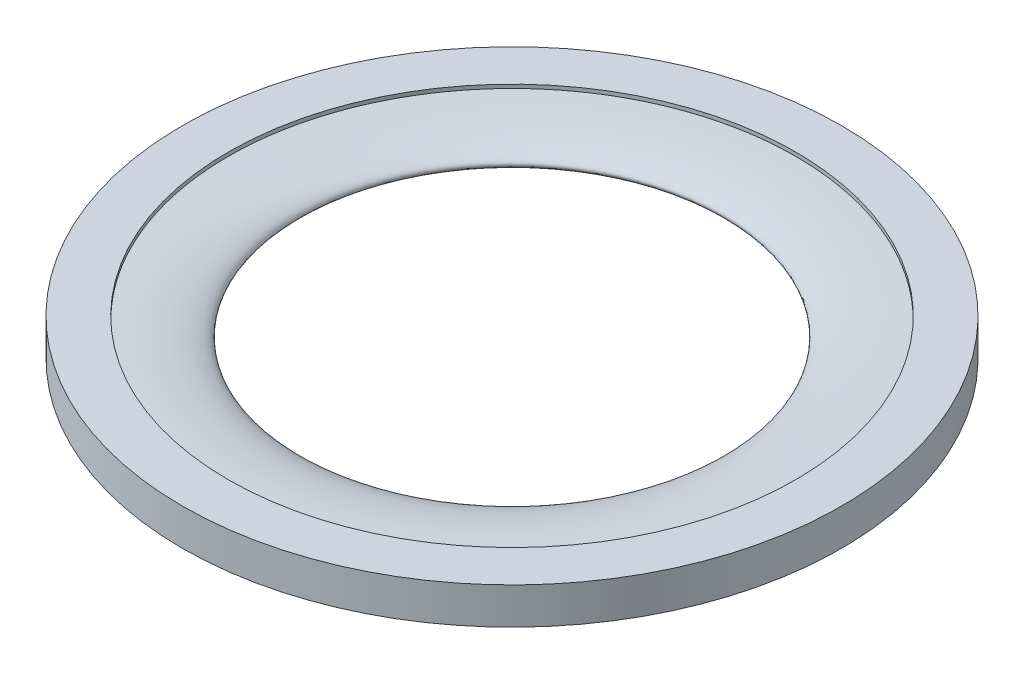
ISO-10303-21;
HEADER;
FILE_DESCRIPTION(('STEP AP214'),'2;1');
FILE_NAME('part.step','',(''),(''),'','','');
FILE_SCHEMA(('AUTOMOTIVE_DESIGN { 1 0 10303 214 1 1 1 1 }'));
ENDSEC;
DATA;
#1=APPLICATION_CONTEXT('core data for automotive mechanical design processes');
#2=APPLICATION_PROTOCOL_DEFINITION('international standard','automotive_design',2000,#1);
#3=PRODUCT_CONTEXT('',#1,'mechanical');
#4=PRODUCT('Part','Part','',(#3));
#5=PRODUCT_RELATED_PRODUCT_CATEGORY('part','',(#4));
#6=PRODUCT_DEFINITION_FORMATION('','',#4);
#7=PRODUCT_DEFINITION_CONTEXT('part definition',#1,'design');
#8=PRODUCT_DEFINITION('design','',#6,#7);
#9=PRODUCT_DEFINITION_SHAPE('','',#8);
#10=(LENGTH_UNIT() NAMED_UNIT(*) SI_UNIT(.MILLI.,.METRE.));
#11=(NAMED_UNIT(*) PLANE_ANGLE_UNIT() SI_UNIT($,.RADIAN.));
#12=(NAMED_UNIT(*) SI_UNIT($,.STERADIAN.) SOLID_ANGLE_UNIT());
#13=UNCERTAINTY_MEASURE_WITH_UNIT(LENGTH_MEASURE(1.E-05),#10,'distance_accuracy_value','');
#14=(GEOMETRIC_REPRESENTATION_CONTEXT(3) GLOBAL_UNCERTAINTY_ASSIGNED_CONTEXT((#13)) GLOBAL_UNIT_ASSIGNED_CONTEXT((#10,
#11,#12)) REPRESENTATION_CONTEXT('',''));
#15=CARTESIAN_POINT('',(0.,0.,0.));
#16=DIRECTION('',(0.,0.,1.));
#17=DIRECTION('',(1.,0.,0.));
#18=AXIS2_PLACEMENT_3D('',#15,#16,#17);
#19=CARTESIAN_POINT('',(0.,0.,0.));
#20=DIRECTION('',(0.,-1.,0.));
#21=DIRECTION('',(0.,0.,-1.));
#22=AXIS2_PLACEMENT_3D('',#19,#20,#21);
#23=CYLINDRICAL_SURFACE('',#22,7.75);
#24=CARTESIAN_POINT('',(0.,0.9,0.));
#25=DIRECTION('',(0.,-1.,0.));
#26=DIRECTION('',(0.,0.,-1.));
#27=AXIS2_PLACEMENT_3D('',#24,#25,#26);
#28=CIRCLE('',#27,7.75);
#29=CARTESIAN_POINT('',(0.,0.9,-7.75));
#30=VERTEX_POINT('',#29);
#31=EDGE_CURVE('E61',#30,#30,#28,.T.);
#32=ORIENTED_EDGE('',*,*,#31,.T.);
#33=EDGE_LOOP('',(#32));
#34=FACE_BOUND('',#33,.T.);
#35=CARTESIAN_POINT('',(0.,0.1,0.));
#36=DIRECTION('',(0.,-1.,0.));
#37=DIRECTION('',(0.,0.,-1.));
#38=AXIS2_PLACEMENT_3D('',#35,#36,#37);
#39=CIRCLE('',#38,7.75);
#40=CARTESIAN_POINT('',(0.,0.1,-7.75));
#41=VERTEX_POINT('',#40);
#42=EDGE_CURVE('E11',#41,#41,#39,.T.);
#43=ORIENTED_EDGE('',*,*,#42,.F.);
#44=EDGE_LOOP('',(#43));
#45=FACE_BOUND('',#44,.T.);
#46=ADVANCED_FACE('F55',(#34,#45),#23,.T.);
#47=CARTESIAN_POINT('',(-7.75,0.5,0.));
#48=DIRECTION('',(0.,0.,1.));
#49=DIRECTION('',(1.,0.,0.));
#50=AXIS2_PLACEMENT_3D('',#47,#48,#49);
#51=ELLIPSE('',#50,2.,0.4);
#52=CARTESIAN_POINT('',(0.,0.,0.));
#53=DIRECTION('',(0.,-1.,0.));
#54=AXIS1_PLACEMENT('',#52,#53);
#55=SURFACE_OF_REVOLUTION('',#51,#54);
#56=ORIENTED_EDGE('',*,*,#31,.F.);
#57=EDGE_LOOP('',(#56));
#58=FACE_BOUND('',#57,.T.);
#59=ORIENTED_EDGE('',*,*,#42,.T.);
#60=EDGE_LOOP('',(#59));
#61=FACE_BOUND('',#60,.T.);
#62=ADVANCED_FACE('F69',(#58,#61),#55,.T.);
#63=CLOSED_SHELL('',(#46,#62));
#64=MANIFOLD_SOLID_BREP('B2',#63);
#65=CARTESIAN_POINT('',(0.,1.,0.));
#66=DIRECTION('',(0.,1.,0.));
#67=DIRECTION('',(0.,0.,1.));
#68=AXIS2_PLACEMENT_3D('',#65,#66,#67);
#69=PLANE('',#68);
#70=CARTESIAN_POINT('',(0.,1.,0.));
#71=DIRECTION('',(0.,1.,0.));
#72=DIRECTION('',(0.,0.,1.));
#73=AXIS2_PLACEMENT_3D('',#70,#71,#72);
#74=CIRCLE('',#73,9.);
#75=CARTESIAN_POINT('',(0.,1.,9.));
#76=VERTEX_POINT('',#75);
#77=EDGE_CURVE('E54',#76,#76,#74,.T.);
#78=ORIENTED_EDGE('',*,*,#77,.T.);
#79=EDGE_LOOP('',(#78));
#80=FACE_BOUND('',#79,.T.);
#81=CARTESIAN_POINT('',(0.,1.,0.));
#82=DIRECTION('',(0.,1.,0.));
#83=DIRECTION('',(0.,0.,1.));
#84=AXIS2_PLACEMENT_3D('',#81,#82,#83);
#85=CIRCLE('',#84,7.75);
#86=CARTESIAN_POINT('',(0.,1.,7.75));
#87=VERTEX_POINT('',#86);
#88=EDGE_CURVE('E105',#87,#87,#85,.T.);
#89=ORIENTED_EDGE('',*,*,#88,.F.);
#90=EDGE_LOOP('',(#89));
#91=FACE_BOUND('',#90,.T.);
#92=ADVANCED_FACE('F92',(#80,#91),#69,.T.);
#93=CARTESIAN_POINT('',(0.,0.,0.));
#94=DIRECTION('',(0.,1.,0.));
#95=DIRECTION('',(0.,0.,1.));
#96=AXIS2_PLACEMENT_3D('',#93,#94,#95);
#97=PLANE('',#96);
#98=CARTESIAN_POINT('',(0.,0.,0.));
#99=DIRECTION('',(0.,1.,0.));
#100=DIRECTION('',(0.,0.,1.));
#101=AXIS2_PLACEMENT_3D('',#98,#99,#100);
#102=CIRCLE('',#101,9.);
#103=CARTESIAN_POINT('',(0.,0.,9.));
#104=VERTEX_POINT('',#103);
#105=EDGE_CURVE('E96',#104,#104,#102,.T.);
#106=ORIENTED_EDGE('',*,*,#105,.F.);
#107=EDGE_LOOP('',(#106));
#108=FACE_BOUND('',#107,.T.);
#109=CARTESIAN_POINT('',(0.,0.,0.));
#110=DIRECTION('',(0.,1.,0.));
#111=DIRECTION('',(0.,0.,1.));
#112=AXIS2_PLACEMENT_3D('',#109,#110,#111);
#113=CIRCLE('',#112,7.75);
#114=CARTESIAN_POINT('',(0.,0.,7.75));
#115=VERTEX_POINT('',#114);
#116=EDGE_CURVE('E107',#115,#115,#113,.T.);
#117=ORIENTED_EDGE('',*,*,#116,.T.);
#118=EDGE_LOOP('',(#117));
#119=FACE_BOUND('',#118,.T.);
#120=ADVANCED_FACE('F119',(#108,#119),#97,.F.);
#121=CARTESIAN_POINT('',(0.,1.,0.));
#122=DIRECTION('',(0.,-1.,0.));
#123=DIRECTION('',(0.,0.,-1.));
#124=AXIS2_PLACEMENT_3D('',#121,#122,#123);
#125=CYLINDRICAL_SURFACE('',#124,9.);
#126=ORIENTED_EDGE('',*,*,#77,.F.);
#127=EDGE_LOOP('',(#126));
#128=FACE_BOUND('',#127,.T.);
#129=ORIENTED_EDGE('',*,*,#105,.T.);
#130=EDGE_LOOP('',(#129));
#131=FACE_BOUND('',#130,.T.);
#132=ADVANCED_FACE('F94',(#128,#131),#125,.T.);
#133=CARTESIAN_POINT('',(0.,1.,0.));
#134=DIRECTION('',(0.,-1.,0.));
#135=DIRECTION('',(0.,0.,-1.));
#136=AXIS2_PLACEMENT_3D('',#133,#134,#135);
#137=CYLINDRICAL_SURFACE('',#136,7.75);
#138=ORIENTED_EDGE('',*,*,#88,.T.);
#139=EDGE_LOOP('',(#138));
#140=FACE_BOUND('',#139,.T.);
#141=ORIENTED_EDGE('',*,*,#116,.F.);
#142=EDGE_LOOP('',(#141));
#143=FACE_BOUND('',#142,.T.);
#144=ADVANCED_FACE('F115',(#140,#143),#137,.F.);
#145=CLOSED_SHELL('',(#92,#120,#132,#144));
#146=MANIFOLD_SOLID_BREP('B6',#145);
#147=ADVANCED_BREP_SHAPE_REPRESENTATION('',(#18,#64,#146),#14);
#148=SHAPE_DEFINITION_REPRESENTATION(#9,#147);
ENDSEC;
END-ISO-10303-21;
